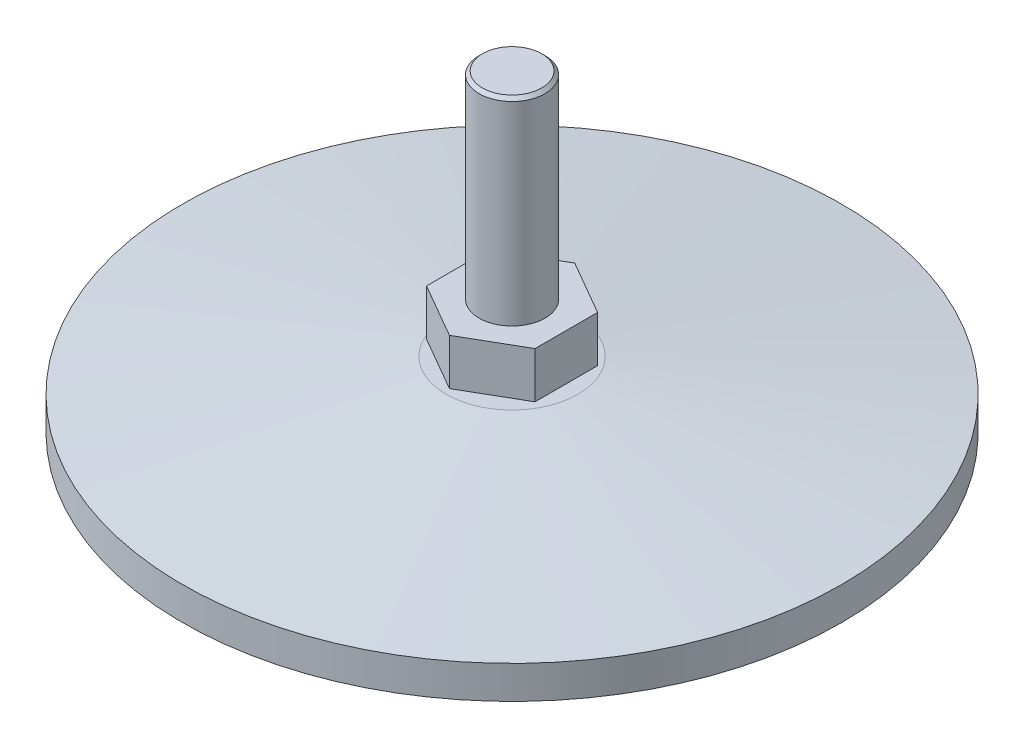
ISO-10303-21;
HEADER;
FILE_DESCRIPTION(('STEP AP214'),'2;1');
FILE_NAME('part.step','',(''),(''),'','','');
FILE_SCHEMA(('AUTOMOTIVE_DESIGN { 1 0 10303 214 1 1 1 1 }'));
ENDSEC;
DATA;
#1=APPLICATION_CONTEXT('core data for automotive mechanical design processes');
#2=APPLICATION_PROTOCOL_DEFINITION('international standard','automotive_design',2000,#1);
#3=PRODUCT_CONTEXT('',#1,'mechanical');
#4=PRODUCT('Part','Part','',(#3));
#5=PRODUCT_RELATED_PRODUCT_CATEGORY('part','',(#4));
#6=PRODUCT_DEFINITION_FORMATION('','',#4);
#7=PRODUCT_DEFINITION_CONTEXT('part definition',#1,'design');
#8=PRODUCT_DEFINITION('design','',#6,#7);
#9=PRODUCT_DEFINITION_SHAPE('','',#8);
#10=(LENGTH_UNIT() NAMED_UNIT(*) SI_UNIT(.MILLI.,.METRE.));
#11=(NAMED_UNIT(*) PLANE_ANGLE_UNIT() SI_UNIT($,.RADIAN.));
#12=(NAMED_UNIT(*) SI_UNIT($,.STERADIAN.) SOLID_ANGLE_UNIT());
#13=UNCERTAINTY_MEASURE_WITH_UNIT(LENGTH_MEASURE(1.E-05),#10,'distance_accuracy_value','');
#14=(GEOMETRIC_REPRESENTATION_CONTEXT(3) GLOBAL_UNCERTAINTY_ASSIGNED_CONTEXT((#13)) GLOBAL_UNIT_ASSIGNED_CONTEXT((#10,
#11,#12)) REPRESENTATION_CONTEXT('',''));
#15=CARTESIAN_POINT('',(0.,0.,0.));
#16=DIRECTION('',(0.,0.,1.));
#17=DIRECTION('',(1.,0.,0.));
#18=AXIS2_PLACEMENT_3D('',#15,#16,#17);
#19=CARTESIAN_POINT('',(-5.,17.5,0.));
#20=DIRECTION('',(0.,-1.,0.));
#21=DIRECTION('',(1.,0.,0.));
#22=AXIS2_PLACEMENT_3D('',#19,#20,#21);
#23=PLANE('',#22);
#24=CARTESIAN_POINT('',(0.,17.5,0.));
#25=DIRECTION('',(0.,-1.,0.));
#26=DIRECTION('',(1.,0.,0.));
#27=AXIS2_PLACEMENT_3D('',#24,#25,#26);
#28=CIRCLE('',#27,4.99999999999999);
#29=CARTESIAN_POINT('',(4.99999999999999,17.5,0.));
#30=VERTEX_POINT('',#29);
#31=EDGE_CURVE('E174',#30,#30,#28,.T.);
#32=ORIENTED_EDGE('',*,*,#31,.T.);
#33=EDGE_LOOP('',(#32));
#34=FACE_BOUND('',#33,.T.);
#35=DIRECTION('',(-0.866025403784442,0.,-0.499999999999995));
#36=VECTOR('',#35,1.);
#37=CARTESIAN_POINT('',(8.22724133595211,17.5,-4.7500000000001));
#38=LINE('',#37,#36);
#39=CARTESIAN_POINT('',(8.22724133595211,17.5,-4.7500000000001));
#40=VERTEX_POINT('',#39);
#41=CARTESIAN_POINT('',(0.,17.5,-9.5));
#42=VERTEX_POINT('',#41);
#43=EDGE_CURVE('E101',#40,#42,#38,.T.);
#44=ORIENTED_EDGE('',*,*,#43,.T.);
#45=DIRECTION('',(-0.866025403784438,0.,0.500000000000001));
#46=VECTOR('',#45,1.);
#47=CARTESIAN_POINT('',(0.,17.5,-9.5));
#48=LINE('',#47,#46);
#49=CARTESIAN_POINT('',(-8.22724133595218,17.5,-4.74999999999998));
#50=VERTEX_POINT('',#49);
#51=EDGE_CURVE('E134',#42,#50,#48,.T.);
#52=ORIENTED_EDGE('',*,*,#51,.T.);
#53=DIRECTION('',(0.,0.,1.));
#54=VECTOR('',#53,1.);
#55=CARTESIAN_POINT('',(-8.22724133595218,17.5,-4.74999999999998));
#56=LINE('',#55,#54);
#57=CARTESIAN_POINT('',(-8.22724133595215,17.5,4.75000000000003));
#58=VERTEX_POINT('',#57);
#59=EDGE_CURVE('E355',#50,#58,#56,.T.);
#60=ORIENTED_EDGE('',*,*,#59,.T.);
#61=DIRECTION('',(0.866025403784442,0.,0.499999999999995));
#62=VECTOR('',#61,1.);
#63=CARTESIAN_POINT('',(-8.22724133595215,17.5,4.75000000000004));
#64=LINE('',#63,#62);
#65=CARTESIAN_POINT('',(0.,17.5,9.5));
#66=VERTEX_POINT('',#65);
#67=EDGE_CURVE('E131',#58,#66,#64,.T.);
#68=ORIENTED_EDGE('',*,*,#67,.T.);
#69=DIRECTION('',(0.866025403784435,0.,-0.500000000000007));
#70=VECTOR('',#69,1.);
#71=CARTESIAN_POINT('',(0.,17.5,9.5));
#72=LINE('',#71,#70);
#73=CARTESIAN_POINT('',(8.22724133595221,17.5,4.74999999999993));
#74=VERTEX_POINT('',#73);
#75=EDGE_CURVE('E70',#66,#74,#72,.T.);
#76=ORIENTED_EDGE('',*,*,#75,.T.);
#77=DIRECTION('',(0.,0.,-1.));
#78=VECTOR('',#77,1.);
#79=CARTESIAN_POINT('',(8.22724133595221,17.5,4.74999999999992));
#80=LINE('',#79,#78);
#81=EDGE_CURVE('E107',#74,#40,#80,.T.);
#82=ORIENTED_EDGE('',*,*,#81,.T.);
#83=EDGE_LOOP('',(#44,#52,#60,#68,#76,#82));
#84=FACE_BOUND('',#83,.T.);
#85=ADVANCED_FACE('F45',(#34,#84),#23,.F.);
#86=CARTESIAN_POINT('',(-9.5,10.5,0.));
#87=DIRECTION('',(0.,1.,0.));
#88=DIRECTION('',(-1.,0.,0.));
#89=AXIS2_PLACEMENT_3D('',#86,#87,#88);
#90=PLANE('',#89);
#91=CARTESIAN_POINT('',(0.,10.5,0.));
#92=DIRECTION('',(0.,-1.,0.));
#93=DIRECTION('',(1.,0.,0.));
#94=AXIS2_PLACEMENT_3D('',#91,#92,#93);
#95=CIRCLE('',#94,5.);
#96=CARTESIAN_POINT('',(5.,10.5,0.));
#97=VERTEX_POINT('',#96);
#98=EDGE_CURVE('E170',#97,#97,#95,.T.);
#99=ORIENTED_EDGE('',*,*,#98,.F.);
#100=EDGE_LOOP('',(#99));
#101=FACE_BOUND('',#100,.T.);
#102=DIRECTION('',(0.866025403784442,0.,0.499999999999995));
#103=VECTOR('',#102,1.);
#104=CARTESIAN_POINT('',(8.22724133595211,10.5,-4.7500000000001));
#105=LINE('',#104,#103);
#106=CARTESIAN_POINT('',(0.,10.5,-9.5));
#107=VERTEX_POINT('',#106);
#108=CARTESIAN_POINT('',(8.22724133595211,10.5,-4.7500000000001));
#109=VERTEX_POINT('',#108);
#110=EDGE_CURVE('E62',#107,#109,#105,.T.);
#111=ORIENTED_EDGE('',*,*,#110,.T.);
#112=DIRECTION('',(0.,0.,1.));
#113=VECTOR('',#112,1.);
#114=CARTESIAN_POINT('',(8.22724133595221,10.5,4.74999999999992));
#115=LINE('',#114,#113);
#116=CARTESIAN_POINT('',(8.22724133595221,10.5,4.74999999999992));
#117=VERTEX_POINT('',#116);
#118=EDGE_CURVE('E115',#109,#117,#115,.T.);
#119=ORIENTED_EDGE('',*,*,#118,.T.);
#120=DIRECTION('',(-0.866025403784435,0.,0.500000000000007));
#121=VECTOR('',#120,1.);
#122=CARTESIAN_POINT('',(0.,10.5,9.5));
#123=LINE('',#122,#121);
#124=CARTESIAN_POINT('',(0.,10.5,9.5));
#125=VERTEX_POINT('',#124);
#126=EDGE_CURVE('E370',#117,#125,#123,.T.);
#127=ORIENTED_EDGE('',*,*,#126,.T.);
#128=DIRECTION('',(-0.866025403784442,0.,-0.499999999999995));
#129=VECTOR('',#128,1.);
#130=CARTESIAN_POINT('',(-8.22724133595215,10.5,4.75000000000004));
#131=LINE('',#130,#129);
#132=CARTESIAN_POINT('',(-8.22724133595215,10.5,4.75000000000003));
#133=VERTEX_POINT('',#132);
#134=EDGE_CURVE('E142',#125,#133,#131,.T.);
#135=ORIENTED_EDGE('',*,*,#134,.T.);
#136=DIRECTION('',(0.,0.,-1.));
#137=VECTOR('',#136,1.);
#138=CARTESIAN_POINT('',(-8.22724133595218,10.5,-4.74999999999998));
#139=LINE('',#138,#137);
#140=CARTESIAN_POINT('',(-8.22724133595218,10.5,-4.74999999999998));
#141=VERTEX_POINT('',#140);
#142=EDGE_CURVE('E357',#133,#141,#139,.T.);
#143=ORIENTED_EDGE('',*,*,#142,.T.);
#144=DIRECTION('',(0.866025403784438,0.,-0.500000000000001));
#145=VECTOR('',#144,1.);
#146=CARTESIAN_POINT('',(0.,10.5,-9.5));
#147=LINE('',#146,#145);
#148=EDGE_CURVE('E118',#141,#107,#147,.T.);
#149=ORIENTED_EDGE('',*,*,#148,.T.);
#150=EDGE_LOOP('',(#111,#119,#127,#135,#143,#149));
#151=FACE_BOUND('',#150,.T.);
#152=ADVANCED_FACE('F113',(#101,#151),#90,.F.);
#153=CARTESIAN_POINT('',(0.,47.5,0.));
#154=DIRECTION('',(0.,-1.,0.));
#155=DIRECTION('',(1.,0.,0.));
#156=AXIS2_PLACEMENT_3D('',#153,#154,#155);
#157=PLANE('',#156);
#158=CARTESIAN_POINT('',(0.,47.5,0.));
#159=DIRECTION('',(0.,-1.,0.));
#160=DIRECTION('',(1.,0.,0.));
#161=AXIS2_PLACEMENT_3D('',#158,#159,#160);
#162=CIRCLE('',#161,4.49999999999998);
#163=CARTESIAN_POINT('',(4.49999999999997,47.5,0.));
#164=VERTEX_POINT('',#163);
#165=EDGE_CURVE('E11',#164,#164,#162,.F.);
#166=ORIENTED_EDGE('',*,*,#165,.T.);
#167=EDGE_LOOP('',(#166));
#168=FACE_BOUND('',#167,.T.);
#169=ADVANCED_FACE('F203',(#168),#157,.F.);
#170=CARTESIAN_POINT('',(0.,0.,0.));
#171=DIRECTION('',(0.,-1.,0.));
#172=DIRECTION('',(1.,0.,0.));
#173=AXIS2_PLACEMENT_3D('',#170,#171,#172);
#174=CYLINDRICAL_SURFACE('',#173,5.);
#175=CARTESIAN_POINT('',(0.,47.,0.));
#176=DIRECTION('',(0.,-1.,0.));
#177=DIRECTION('',(1.,0.,0.));
#178=AXIS2_PLACEMENT_3D('',#175,#176,#177);
#179=CIRCLE('',#178,5.);
#180=CARTESIAN_POINT('',(4.99999999999999,47.,0.));
#181=VERTEX_POINT('',#180);
#182=EDGE_CURVE('E55',#181,#181,#179,.T.);
#183=ORIENTED_EDGE('',*,*,#182,.T.);
#184=EDGE_LOOP('',(#183));
#185=FACE_BOUND('',#184,.T.);
#186=ORIENTED_EDGE('',*,*,#31,.F.);
#187=EDGE_LOOP('',(#186));
#188=FACE_BOUND('',#187,.T.);
#189=ADVANCED_FACE('F181',(#185,#188),#174,.T.);
#190=CARTESIAN_POINT('',(0.,0.,0.));
#191=DIRECTION('',(0.,-1.,0.));
#192=DIRECTION('',(1.,0.,0.));
#193=AXIS2_PLACEMENT_3D('',#190,#191,#192);
#194=CYLINDRICAL_SURFACE('',#193,5.);
#195=CARTESIAN_POINT('',(0.,10.,0.));
#196=DIRECTION('',(0.,-1.,0.));
#197=DIRECTION('',(1.,0.,0.));
#198=AXIS2_PLACEMENT_3D('',#195,#196,#197);
#199=CIRCLE('',#198,5.);
#200=CARTESIAN_POINT('',(5.,10.,0.));
#201=VERTEX_POINT('',#200);
#202=EDGE_CURVE('E166',#201,#201,#199,.T.);
#203=ORIENTED_EDGE('',*,*,#202,.F.);
#204=EDGE_LOOP('',(#203));
#205=FACE_BOUND('',#204,.T.);
#206=ORIENTED_EDGE('',*,*,#98,.T.);
#207=EDGE_LOOP('',(#206));
#208=FACE_BOUND('',#207,.T.);
#209=ADVANCED_FACE('F210',(#205,#208),#194,.T.);
#210=CARTESIAN_POINT('',(-5.,10.,0.));
#211=DIRECTION('',(0.,-1.,0.));
#212=DIRECTION('',(1.,0.,0.));
#213=AXIS2_PLACEMENT_3D('',#210,#211,#212);
#214=PLANE('',#213);
#215=CARTESIAN_POINT('',(0.,10.,0.));
#216=DIRECTION('',(0.,-1.,0.));
#217=DIRECTION('',(1.,0.,0.));
#218=AXIS2_PLACEMENT_3D('',#215,#216,#217);
#219=CIRCLE('',#218,10.);
#220=CARTESIAN_POINT('',(10.,10.,0.));
#221=VERTEX_POINT('',#220);
#222=EDGE_CURVE('E162',#221,#221,#219,.T.);
#223=ORIENTED_EDGE('',*,*,#222,.F.);
#224=EDGE_LOOP('',(#223));
#225=FACE_BOUND('',#224,.T.);
#226=ORIENTED_EDGE('',*,*,#202,.T.);
#227=EDGE_LOOP('',(#226));
#228=FACE_BOUND('',#227,.T.);
#229=ADVANCED_FACE('F227',(#225,#228),#214,.F.);
#230=CARTESIAN_POINT('',(0.,10.,0.));
#231=DIRECTION('',(0.,-1.,0.));
#232=DIRECTION('',(1.,0.,0.));
#233=AXIS2_PLACEMENT_3D('',#230,#231,#232);
#234=CONICAL_SURFACE('',#233,10.,1.44644133224814);
#235=CARTESIAN_POINT('',(0.,5.00000000000001,0.));
#236=DIRECTION('',(0.,-1.,0.));
#237=DIRECTION('',(1.,0.,0.));
#238=AXIS2_PLACEMENT_3D('',#235,#236,#237);
#239=CIRCLE('',#238,50.);
#240=CARTESIAN_POINT('',(50.,5.00000000000001,0.));
#241=VERTEX_POINT('',#240);
#242=EDGE_CURVE('E158',#241,#241,#239,.T.);
#243=ORIENTED_EDGE('',*,*,#242,.F.);
#244=EDGE_LOOP('',(#243));
#245=FACE_BOUND('',#244,.T.);
#246=ORIENTED_EDGE('',*,*,#222,.T.);
#247=EDGE_LOOP('',(#246));
#248=FACE_BOUND('',#247,.T.);
#249=ADVANCED_FACE('F234',(#245,#248),#234,.T.);
#250=CARTESIAN_POINT('',(0.,0.,0.));
#251=DIRECTION('',(0.,-1.,0.));
#252=DIRECTION('',(1.,0.,0.));
#253=AXIS2_PLACEMENT_3D('',#250,#251,#252);
#254=CYLINDRICAL_SURFACE('',#253,50.);
#255=CARTESIAN_POINT('',(0.,0.,0.));
#256=DIRECTION('',(0.,-1.,0.));
#257=DIRECTION('',(1.,0.,0.));
#258=AXIS2_PLACEMENT_3D('',#255,#256,#257);
#259=CIRCLE('',#258,50.);
#260=CARTESIAN_POINT('',(50.,0.,0.));
#261=VERTEX_POINT('',#260);
#262=EDGE_CURVE('E154',#261,#261,#259,.T.);
#263=ORIENTED_EDGE('',*,*,#262,.F.);
#264=EDGE_LOOP('',(#263));
#265=FACE_BOUND('',#264,.T.);
#266=ORIENTED_EDGE('',*,*,#242,.T.);
#267=EDGE_LOOP('',(#266));
#268=FACE_BOUND('',#267,.T.);
#269=ADVANCED_FACE('F242',(#265,#268),#254,.T.);
#270=CARTESIAN_POINT('',(-50.,0.,0.));
#271=DIRECTION('',(0.,1.,0.));
#272=DIRECTION('',(-1.,0.,0.));
#273=AXIS2_PLACEMENT_3D('',#270,#271,#272);
#274=PLANE('',#273);
#275=CARTESIAN_POINT('',(0.,0.,0.));
#276=DIRECTION('',(0.,-1.,0.));
#277=DIRECTION('',(1.,0.,0.));
#278=AXIS2_PLACEMENT_3D('',#275,#276,#277);
#279=CIRCLE('',#278,5.);
#280=CARTESIAN_POINT('',(5.,0.,0.));
#281=VERTEX_POINT('',#280);
#282=EDGE_CURVE('E150',#281,#281,#279,.T.);
#283=ORIENTED_EDGE('',*,*,#282,.F.);
#284=EDGE_LOOP('',(#283));
#285=FACE_BOUND('',#284,.T.);
#286=ORIENTED_EDGE('',*,*,#262,.T.);
#287=EDGE_LOOP('',(#286));
#288=FACE_BOUND('',#287,.T.);
#289=ADVANCED_FACE('F250',(#285,#288),#274,.F.);
#290=CARTESIAN_POINT('',(0.,0.,0.));
#291=DIRECTION('',(0.,-1.,0.));
#292=DIRECTION('',(1.,0.,0.));
#293=AXIS2_PLACEMENT_3D('',#290,#291,#292);
#294=CYLINDRICAL_SURFACE('',#293,5.);
#295=CARTESIAN_POINT('',(0.,7.,0.));
#296=DIRECTION('',(0.,-1.,0.));
#297=DIRECTION('',(1.,0.,0.));
#298=AXIS2_PLACEMENT_3D('',#295,#296,#297);
#299=CIRCLE('',#298,5.);
#300=CARTESIAN_POINT('',(5.,7.,0.));
#301=VERTEX_POINT('',#300);
#302=EDGE_CURVE('E139',#301,#301,#299,.T.);
#303=ORIENTED_EDGE('',*,*,#302,.F.);
#304=EDGE_LOOP('',(#303));
#305=FACE_BOUND('',#304,.T.);
#306=ORIENTED_EDGE('',*,*,#282,.T.);
#307=EDGE_LOOP('',(#306));
#308=FACE_BOUND('',#307,.T.);
#309=ADVANCED_FACE('F193',(#305,#308),#294,.F.);
#310=CARTESIAN_POINT('',(0.,7.,0.));
#311=DIRECTION('',(0.,1.,0.));
#312=DIRECTION('',(-1.,0.,0.));
#313=AXIS2_PLACEMENT_3D('',#310,#311,#312);
#314=PLANE('',#313);
#315=ORIENTED_EDGE('',*,*,#302,.T.);
#316=EDGE_LOOP('',(#315));
#317=FACE_BOUND('',#316,.T.);
#318=ADVANCED_FACE('F185',(#317),#314,.F.);
#319=CARTESIAN_POINT('',(0.,47.,0.));
#320=DIRECTION('',(0.,-1.,0.));
#321=DIRECTION('',(1.,0.,0.));
#322=AXIS2_PLACEMENT_3D('',#319,#320,#321);
#323=CONICAL_SURFACE('',#322,5.,0.785398163397447);
#324=ORIENTED_EDGE('',*,*,#165,.F.);
#325=EDGE_LOOP('',(#324));
#326=FACE_BOUND('',#325,.T.);
#327=ORIENTED_EDGE('',*,*,#182,.F.);
#328=EDGE_LOOP('',(#327));
#329=FACE_BOUND('',#328,.T.);
#330=ADVANCED_FACE('F48',(#326,#329),#323,.T.);
#331=CARTESIAN_POINT('',(8.22724133595221,-0.00100000000000794,4.74999999999992));
#332=DIRECTION('',(1.,0.,0.));
#333=DIRECTION('',(0.,0.,-1.));
#334=AXIS2_PLACEMENT_3D('',#331,#332,#333);
#335=PLANE('',#334);
#336=DIRECTION('',(0.,-1.,0.));
#337=VECTOR('',#336,1.);
#338=CARTESIAN_POINT('',(8.22724133595211,0.,-4.75000000000009));
#339=LINE('',#338,#337);
#340=EDGE_CURVE('E98',#40,#109,#339,.T.);
#341=ORIENTED_EDGE('',*,*,#340,.F.);
#342=ORIENTED_EDGE('',*,*,#81,.F.);
#343=DIRECTION('',(0.,-1.,0.));
#344=VECTOR('',#343,1.);
#345=CARTESIAN_POINT('',(8.22724133595221,0.,4.74999999999993));
#346=LINE('',#345,#344);
#347=EDGE_CURVE('E108',#74,#117,#346,.T.);
#348=ORIENTED_EDGE('',*,*,#347,.T.);
#349=ORIENTED_EDGE('',*,*,#118,.F.);
#350=EDGE_LOOP('',(#341,#342,#348,#349));
#351=FACE_BOUND('',#350,.T.);
#352=ADVANCED_FACE('F123',(#351),#335,.T.);
#353=CARTESIAN_POINT('',(-8.22724133595214,-0.00100000000000794,4.75000000000004));
#354=DIRECTION('',(-0.499999999999995,0.,0.866025403784442));
#355=DIRECTION('',(0.866025403784442,0.,0.499999999999995));
#356=AXIS2_PLACEMENT_3D('',#353,#354,#355);
#357=PLANE('',#356);
#358=DIRECTION('',(0.,-1.,0.));
#359=VECTOR('',#358,1.);
#360=CARTESIAN_POINT('',(0.,0.,9.5));
#361=LINE('',#360,#359);
#362=EDGE_CURVE('E365',#66,#125,#361,.T.);
#363=ORIENTED_EDGE('',*,*,#362,.F.);
#364=ORIENTED_EDGE('',*,*,#67,.F.);
#365=DIRECTION('',(0.,-1.,0.));
#366=VECTOR('',#365,1.);
#367=CARTESIAN_POINT('',(-8.22724133595215,0.,4.75000000000003));
#368=LINE('',#367,#366);
#369=EDGE_CURVE('E125',#58,#133,#368,.T.);
#370=ORIENTED_EDGE('',*,*,#369,.T.);
#371=ORIENTED_EDGE('',*,*,#134,.F.);
#372=EDGE_LOOP('',(#363,#364,#370,#371));
#373=FACE_BOUND('',#372,.T.);
#374=ADVANCED_FACE('F191',(#373),#357,.T.);
#375=CARTESIAN_POINT('',(0.,-0.00100000000000794,-9.5));
#376=DIRECTION('',(-0.500000000000001,0.,-0.866025403784438));
#377=DIRECTION('',(-0.866025403784438,0.,0.500000000000001));
#378=AXIS2_PLACEMENT_3D('',#375,#376,#377);
#379=PLANE('',#378);
#380=DIRECTION('',(0.,1.,0.));
#381=VECTOR('',#380,1.);
#382=CARTESIAN_POINT('',(-8.22724133595218,-0.00100000000000794,-4.74999999999998));
#383=LINE('',#382,#381);
#384=EDGE_CURVE('E363',#141,#50,#383,.T.);
#385=ORIENTED_EDGE('',*,*,#384,.T.);
#386=ORIENTED_EDGE('',*,*,#51,.F.);
#387=DIRECTION('',(0.,1.,0.));
#388=VECTOR('',#387,1.);
#389=CARTESIAN_POINT('',(0.,-0.00100000000000794,-9.5));
#390=LINE('',#389,#388);
#391=EDGE_CURVE('E120',#107,#42,#390,.T.);
#392=ORIENTED_EDGE('',*,*,#391,.F.);
#393=ORIENTED_EDGE('',*,*,#148,.F.);
#394=EDGE_LOOP('',(#385,#386,#392,#393));
#395=FACE_BOUND('',#394,.T.);
#396=ADVANCED_FACE('F313',(#395),#379,.T.);
#397=CARTESIAN_POINT('',(0.,-0.00100000000000794,9.5));
#398=DIRECTION('',(0.500000000000007,0.,0.866025403784435));
#399=DIRECTION('',(0.866025403784435,0.,-0.500000000000007));
#400=AXIS2_PLACEMENT_3D('',#397,#398,#399);
#401=PLANE('',#400);
#402=ORIENTED_EDGE('',*,*,#347,.F.);
#403=ORIENTED_EDGE('',*,*,#75,.F.);
#404=ORIENTED_EDGE('',*,*,#362,.T.);
#405=ORIENTED_EDGE('',*,*,#126,.F.);
#406=EDGE_LOOP('',(#402,#403,#404,#405));
#407=FACE_BOUND('',#406,.T.);
#408=ADVANCED_FACE('F323',(#407),#401,.T.);
#409=CARTESIAN_POINT('',(-8.22724133595218,-0.00100000000000794,-4.74999999999998));
#410=DIRECTION('',(-1.,0.,0.));
#411=DIRECTION('',(0.,0.,1.));
#412=AXIS2_PLACEMENT_3D('',#409,#410,#411);
#413=PLANE('',#412);
#414=ORIENTED_EDGE('',*,*,#369,.F.);
#415=ORIENTED_EDGE('',*,*,#59,.F.);
#416=ORIENTED_EDGE('',*,*,#384,.F.);
#417=ORIENTED_EDGE('',*,*,#142,.F.);
#418=EDGE_LOOP('',(#414,#415,#416,#417));
#419=FACE_BOUND('',#418,.T.);
#420=ADVANCED_FACE('F333',(#419),#413,.T.);
#421=CARTESIAN_POINT('',(8.22724133595211,-0.00100000000000794,-4.7500000000001));
#422=DIRECTION('',(0.499999999999995,0.,-0.866025403784441));
#423=DIRECTION('',(-0.866025403784442,0.,-0.499999999999995));
#424=AXIS2_PLACEMENT_3D('',#421,#422,#423);
#425=PLANE('',#424);
#426=ORIENTED_EDGE('',*,*,#391,.T.);
#427=ORIENTED_EDGE('',*,*,#43,.F.);
#428=ORIENTED_EDGE('',*,*,#340,.T.);
#429=ORIENTED_EDGE('',*,*,#110,.F.);
#430=EDGE_LOOP('',(#426,#427,#428,#429));
#431=FACE_BOUND('',#430,.T.);
#432=ADVANCED_FACE('F99',(#431),#425,.T.);
#433=CLOSED_SHELL('',(#85,#152,#169,#189,#209,#229,#249,#269,#289,#309,#318,#330,#352,#374,#396,
#408,#420,#432));
#434=MANIFOLD_SOLID_BREP('B2',#433);
#435=ADVANCED_BREP_SHAPE_REPRESENTATION('',(#18,#434),#14);
#436=SHAPE_DEFINITION_REPRESENTATION(#9,#435);
ENDSEC;
END-ISO-10303-21;
